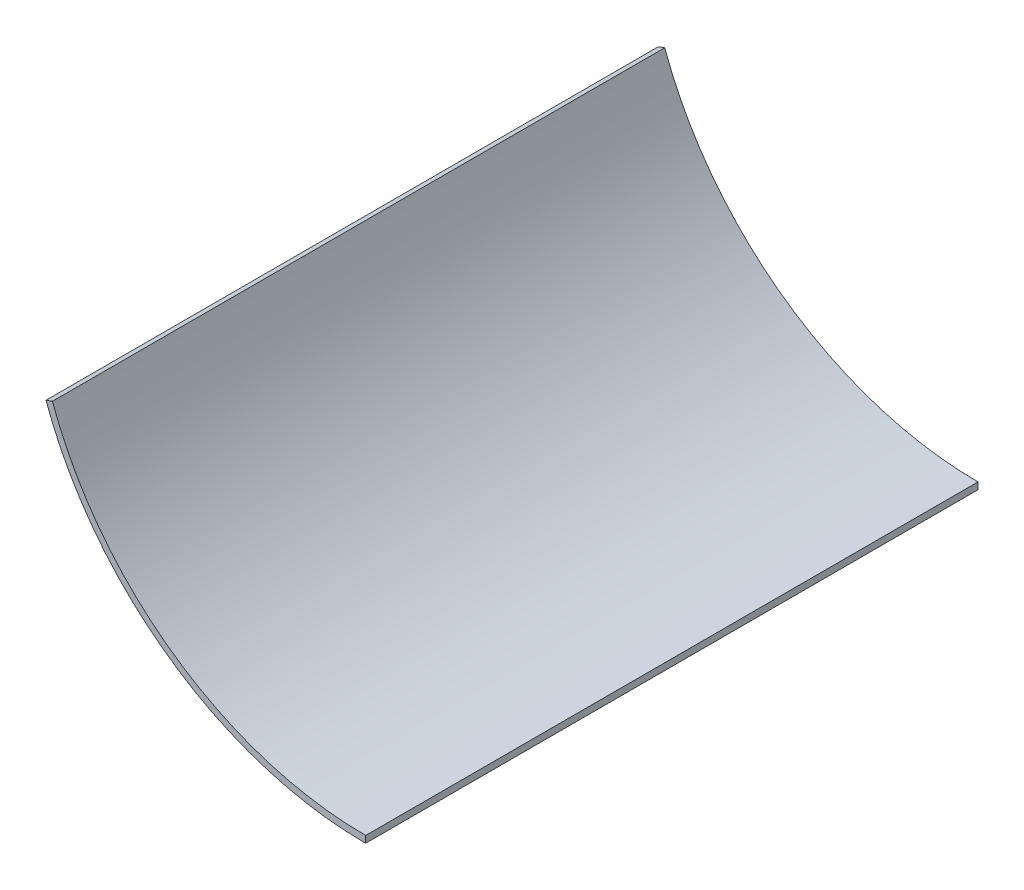
ISO-10303-21;
HEADER;
FILE_DESCRIPTION(('STEP AP214'),'2;1');
FILE_NAME('part.step','',(''),(''),'','','');
FILE_SCHEMA(('AUTOMOTIVE_DESIGN { 1 0 10303 214 1 1 1 1 }'));
ENDSEC;
DATA;
#1=APPLICATION_CONTEXT('core data for automotive mechanical design processes');
#2=APPLICATION_PROTOCOL_DEFINITION('international standard','automotive_design',2000,#1);
#3=PRODUCT_CONTEXT('',#1,'mechanical');
#4=PRODUCT('Part','Part','',(#3));
#5=PRODUCT_RELATED_PRODUCT_CATEGORY('part','',(#4));
#6=PRODUCT_DEFINITION_FORMATION('','',#4);
#7=PRODUCT_DEFINITION_CONTEXT('part definition',#1,'design');
#8=PRODUCT_DEFINITION('design','',#6,#7);
#9=PRODUCT_DEFINITION_SHAPE('','',#8);
#10=(LENGTH_UNIT() NAMED_UNIT(*) SI_UNIT(.MILLI.,.METRE.));
#11=(NAMED_UNIT(*) PLANE_ANGLE_UNIT() SI_UNIT($,.RADIAN.));
#12=(NAMED_UNIT(*) SI_UNIT($,.STERADIAN.) SOLID_ANGLE_UNIT());
#13=UNCERTAINTY_MEASURE_WITH_UNIT(LENGTH_MEASURE(1.E-05),#10,'distance_accuracy_value','');
#14=(GEOMETRIC_REPRESENTATION_CONTEXT(3) GLOBAL_UNCERTAINTY_ASSIGNED_CONTEXT((#13)) GLOBAL_UNIT_ASSIGNED_CONTEXT((#10,
#11,#12)) REPRESENTATION_CONTEXT('',''));
#15=CARTESIAN_POINT('',(0.,0.,0.));
#16=DIRECTION('',(0.,0.,1.));
#17=DIRECTION('',(1.,0.,0.));
#18=AXIS2_PLACEMENT_3D('',#15,#16,#17);
#19=CARTESIAN_POINT('',(0.,0.,900.));
#20=DIRECTION('',(0.,0.,-1.));
#21=DIRECTION('',(-1.,0.,0.));
#22=AXIS2_PLACEMENT_3D('',#19,#20,#21);
#23=CYLINDRICAL_SURFACE('',#22,500.);
#24=CARTESIAN_POINT('',(0.,0.,0.));
#25=DIRECTION('',(0.,0.,1.));
#26=DIRECTION('',(1.,0.,0.));
#27=AXIS2_PLACEMENT_3D('',#24,#25,#26);
#28=CIRCLE('',#27,500.);
#29=CARTESIAN_POINT('',(-469.846310392955,-171.010071662833,0.));
#30=VERTEX_POINT('',#29);
#31=CARTESIAN_POINT('',(1.11022302462516E-13,-499.999999999999,0.));
#32=VERTEX_POINT('',#31);
#33=EDGE_CURVE('E107',#30,#32,#28,.T.);
#34=ORIENTED_EDGE('',*,*,#33,.T.);
#35=DIRECTION('',(0.,0.,-1.));
#36=VECTOR('',#35,1.);
#37=CARTESIAN_POINT('',(1.11022302462516E-13,-499.999999999999,900.));
#38=LINE('',#37,#36);
#39=CARTESIAN_POINT('',(1.11022302462516E-13,-499.999999999999,900.));
#40=VERTEX_POINT('',#39);
#41=EDGE_CURVE('E11',#40,#32,#38,.T.);
#42=ORIENTED_EDGE('',*,*,#41,.F.);
#43=CARTESIAN_POINT('',(0.,0.,900.));
#44=DIRECTION('',(0.,0.,1.));
#45=DIRECTION('',(1.,0.,0.));
#46=AXIS2_PLACEMENT_3D('',#43,#44,#45);
#47=CIRCLE('',#46,500.);
#48=CARTESIAN_POINT('',(-469.846310392955,-171.010071662833,900.));
#49=VERTEX_POINT('',#48);
#50=EDGE_CURVE('E91',#49,#40,#47,.T.);
#51=ORIENTED_EDGE('',*,*,#50,.F.);
#52=DIRECTION('',(0.,0.,-1.));
#53=VECTOR('',#52,1.);
#54=CARTESIAN_POINT('',(-469.846310392955,-171.010071662833,900.));
#55=LINE('',#54,#53);
#56=EDGE_CURVE('E103',#49,#30,#55,.T.);
#57=ORIENTED_EDGE('',*,*,#56,.T.);
#58=EDGE_LOOP('',(#34,#42,#51,#57));
#59=FACE_BOUND('',#58,.T.);
#60=ADVANCED_FACE('F39',(#59),#23,.T.);
#61=CARTESIAN_POINT('',(1.11022302462516E-13,-499.999999999999,900.));
#62=DIRECTION('',(-1.,0.,0.));
#63=DIRECTION('',(0.,0.,1.));
#64=AXIS2_PLACEMENT_3D('',#61,#62,#63);
#65=PLANE('',#64);
#66=DIRECTION('',(0.,1.,0.));
#67=VECTOR('',#66,1.);
#68=CARTESIAN_POINT('',(1.11022302462516E-13,-499.999999999999,0.));
#69=LINE('',#68,#67);
#70=CARTESIAN_POINT('',(0.,-490.,0.));
#71=VERTEX_POINT('',#70);
#72=EDGE_CURVE('E96',#32,#71,#69,.T.);
#73=ORIENTED_EDGE('',*,*,#72,.T.);
#74=DIRECTION('',(0.,0.,-1.));
#75=VECTOR('',#74,1.);
#76=CARTESIAN_POINT('',(0.,-490.,900.));
#77=LINE('',#76,#75);
#78=CARTESIAN_POINT('',(0.,-490.,900.));
#79=VERTEX_POINT('',#78);
#80=EDGE_CURVE('E48',#79,#71,#77,.T.);
#81=ORIENTED_EDGE('',*,*,#80,.F.);
#82=DIRECTION('',(0.,1.,0.));
#83=VECTOR('',#82,1.);
#84=CARTESIAN_POINT('',(1.11022302462516E-13,-499.999999999999,900.));
#85=LINE('',#84,#83);
#86=EDGE_CURVE('E86',#40,#79,#85,.T.);
#87=ORIENTED_EDGE('',*,*,#86,.F.);
#88=ORIENTED_EDGE('',*,*,#41,.T.);
#89=EDGE_LOOP('',(#73,#81,#87,#88));
#90=FACE_BOUND('',#89,.T.);
#91=ADVANCED_FACE('F95',(#90),#65,.F.);
#92=CARTESIAN_POINT('',(0.,0.,900.));
#93=DIRECTION('',(0.,0.,-1.));
#94=DIRECTION('',(-1.,0.,0.));
#95=AXIS2_PLACEMENT_3D('',#92,#93,#94);
#96=CYLINDRICAL_SURFACE('',#95,490.);
#97=CARTESIAN_POINT('',(0.,0.,0.));
#98=DIRECTION('',(0.,0.,-1.));
#99=DIRECTION('',(1.,0.,0.));
#100=AXIS2_PLACEMENT_3D('',#97,#98,#99);
#101=CIRCLE('',#100,490.);
#102=CARTESIAN_POINT('',(-460.449384185096,-167.589870229577,0.));
#103=VERTEX_POINT('',#102);
#104=EDGE_CURVE('E73',#71,#103,#101,.T.);
#105=ORIENTED_EDGE('',*,*,#104,.T.);
#106=DIRECTION('',(0.,0.,-1.));
#107=VECTOR('',#106,1.);
#108=CARTESIAN_POINT('',(-460.449384185096,-167.589870229577,900.));
#109=LINE('',#108,#107);
#110=CARTESIAN_POINT('',(-460.449384185096,-167.589870229577,900.));
#111=VERTEX_POINT('',#110);
#112=EDGE_CURVE('E98',#111,#103,#109,.T.);
#113=ORIENTED_EDGE('',*,*,#112,.F.);
#114=CARTESIAN_POINT('',(0.,0.,900.));
#115=DIRECTION('',(0.,0.,-1.));
#116=DIRECTION('',(1.,0.,0.));
#117=AXIS2_PLACEMENT_3D('',#114,#115,#116);
#118=CIRCLE('',#117,490.);
#119=EDGE_CURVE('E89',#79,#111,#118,.T.);
#120=ORIENTED_EDGE('',*,*,#119,.F.);
#121=ORIENTED_EDGE('',*,*,#80,.T.);
#122=EDGE_LOOP('',(#105,#113,#120,#121));
#123=FACE_BOUND('',#122,.T.);
#124=ADVANCED_FACE('F99',(#123),#96,.F.);
#125=CARTESIAN_POINT('',(-469.846310392955,-171.010071662833,900.));
#126=DIRECTION('',(0.342020143325663,-0.939692620785911,0.));
#127=DIRECTION('',(0.939692620785911,0.342020143325663,0.));
#128=AXIS2_PLACEMENT_3D('',#125,#126,#127);
#129=PLANE('',#128);
#130=DIRECTION('',(-0.939692620785911,-0.342020143325663,0.));
#131=VECTOR('',#130,1.);
#132=CARTESIAN_POINT('',(-469.846310392955,-171.010071662833,0.));
#133=LINE('',#132,#131);
#134=EDGE_CURVE('E79',#103,#30,#133,.T.);
#135=ORIENTED_EDGE('',*,*,#134,.T.);
#136=ORIENTED_EDGE('',*,*,#56,.F.);
#137=DIRECTION('',(-0.939692620785911,-0.342020143325663,0.));
#138=VECTOR('',#137,1.);
#139=CARTESIAN_POINT('',(-469.846310392955,-171.010071662833,900.));
#140=LINE('',#139,#138);
#141=EDGE_CURVE('E56',#111,#49,#140,.T.);
#142=ORIENTED_EDGE('',*,*,#141,.F.);
#143=ORIENTED_EDGE('',*,*,#112,.T.);
#144=EDGE_LOOP('',(#135,#136,#142,#143));
#145=FACE_BOUND('',#144,.T.);
#146=ADVANCED_FACE('F120',(#145),#129,.F.);
#147=CARTESIAN_POINT('',(0.,0.,900.));
#148=DIRECTION('',(0.,0.,1.));
#149=DIRECTION('',(1.,0.,0.));
#150=AXIS2_PLACEMENT_3D('',#147,#148,#149);
#151=PLANE('',#150);
#152=ORIENTED_EDGE('',*,*,#50,.T.);
#153=ORIENTED_EDGE('',*,*,#86,.T.);
#154=ORIENTED_EDGE('',*,*,#119,.T.);
#155=ORIENTED_EDGE('',*,*,#141,.T.);
#156=EDGE_LOOP('',(#152,#153,#154,#155));
#157=FACE_BOUND('',#156,.T.);
#158=ADVANCED_FACE('F87',(#157),#151,.T.);
#159=CARTESIAN_POINT('',(0.,0.,0.));
#160=DIRECTION('',(0.,0.,1.));
#161=DIRECTION('',(1.,0.,0.));
#162=AXIS2_PLACEMENT_3D('',#159,#160,#161);
#163=PLANE('',#162);
#164=ORIENTED_EDGE('',*,*,#33,.F.);
#165=ORIENTED_EDGE('',*,*,#134,.F.);
#166=ORIENTED_EDGE('',*,*,#104,.F.);
#167=ORIENTED_EDGE('',*,*,#72,.F.);
#168=EDGE_LOOP('',(#164,#165,#166,#167));
#169=FACE_BOUND('',#168,.T.);
#170=ADVANCED_FACE('F123',(#169),#163,.F.);
#171=CLOSED_SHELL('',(#60,#91,#124,#146,#158,#170));
#172=MANIFOLD_SOLID_BREP('B2',#171);
#173=ADVANCED_BREP_SHAPE_REPRESENTATION('',(#18,#172),#14);
#174=SHAPE_DEFINITION_REPRESENTATION(#9,#173);
ENDSEC;
END-ISO-10303-21;
